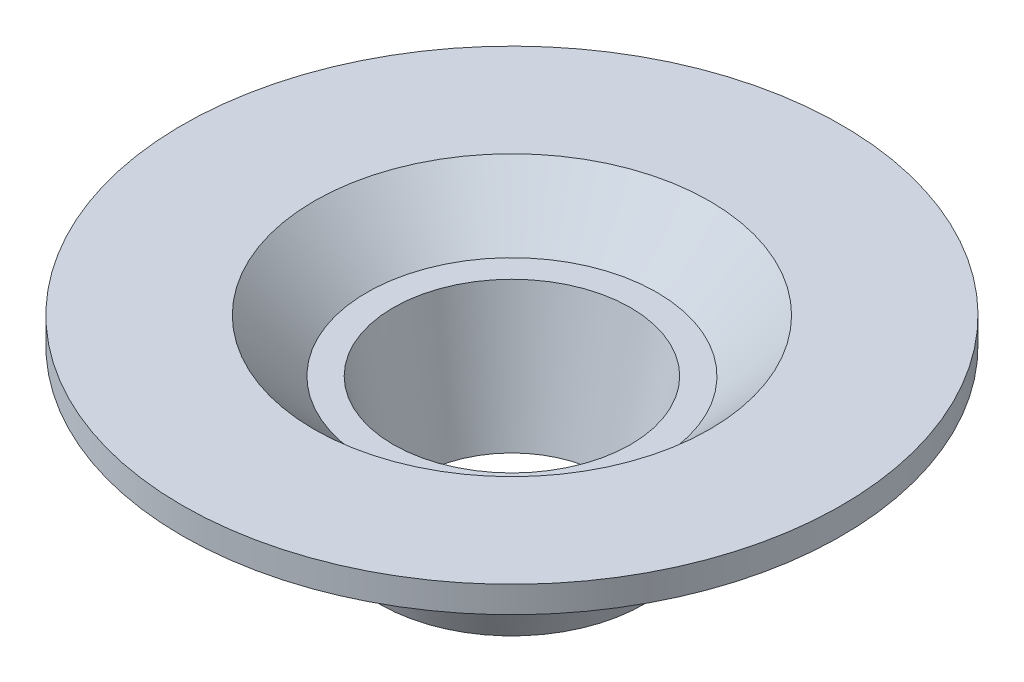
ISO-10303-21;
HEADER;
FILE_DESCRIPTION(('STEP AP214'),'2;1');
FILE_NAME('part.step','',(''),(''),'','','');
FILE_SCHEMA(('AUTOMOTIVE_DESIGN { 1 0 10303 214 1 1 1 1 }'));
ENDSEC;
DATA;
#1=APPLICATION_CONTEXT('core data for automotive mechanical design processes');
#2=APPLICATION_PROTOCOL_DEFINITION('international standard','automotive_design',2000,#1);
#3=PRODUCT_CONTEXT('',#1,'mechanical');
#4=PRODUCT('Part','Part','',(#3));
#5=PRODUCT_RELATED_PRODUCT_CATEGORY('part','',(#4));
#6=PRODUCT_DEFINITION_FORMATION('','',#4);
#7=PRODUCT_DEFINITION_CONTEXT('part definition',#1,'design');
#8=PRODUCT_DEFINITION('design','',#6,#7);
#9=PRODUCT_DEFINITION_SHAPE('','',#8);
#10=(LENGTH_UNIT() NAMED_UNIT(*) SI_UNIT(.MILLI.,.METRE.));
#11=(NAMED_UNIT(*) PLANE_ANGLE_UNIT() SI_UNIT($,.RADIAN.));
#12=(NAMED_UNIT(*) SI_UNIT($,.STERADIAN.) SOLID_ANGLE_UNIT());
#13=UNCERTAINTY_MEASURE_WITH_UNIT(LENGTH_MEASURE(1.E-05),#10,'distance_accuracy_value','');
#14=(GEOMETRIC_REPRESENTATION_CONTEXT(3) GLOBAL_UNCERTAINTY_ASSIGNED_CONTEXT((#13)) GLOBAL_UNIT_ASSIGNED_CONTEXT((#10,
#11,#12)) REPRESENTATION_CONTEXT('',''));
#15=CARTESIAN_POINT('',(0.,0.,0.));
#16=DIRECTION('',(0.,0.,1.));
#17=DIRECTION('',(1.,0.,0.));
#18=AXIS2_PLACEMENT_3D('',#15,#16,#17);
#19=CARTESIAN_POINT('',(0.,-5.,-3.5));
#20=DIRECTION('',(0.,1.,0.));
#21=DIRECTION('',(0.,0.,1.));
#22=AXIS2_PLACEMENT_3D('',#19,#20,#21);
#23=PLANE('',#22);
#24=CARTESIAN_POINT('',(0.,-5.,0.));
#25=DIRECTION('',(0.,1.,0.));
#26=DIRECTION('',(0.,0.,1.));
#27=AXIS2_PLACEMENT_3D('',#24,#25,#26);
#28=CIRCLE('',#27,5.);
#29=CARTESIAN_POINT('',(0.,-5.,5.));
#30=VERTEX_POINT('',#29);
#31=EDGE_CURVE('E10',#30,#30,#28,.T.);
#32=ORIENTED_EDGE('',*,*,#31,.F.);
#33=EDGE_LOOP('',(#32));
#34=FACE_BOUND('',#33,.T.);
#35=CARTESIAN_POINT('',(0.,-5.,0.));
#36=DIRECTION('',(0.,1.,0.));
#37=DIRECTION('',(0.,0.,1.));
#38=AXIS2_PLACEMENT_3D('',#35,#36,#37);
#39=CIRCLE('',#38,3.5);
#40=CARTESIAN_POINT('',(0.,-5.,3.5));
#41=VERTEX_POINT('',#40);
#42=EDGE_CURVE('E65',#41,#41,#39,.T.);
#43=ORIENTED_EDGE('',*,*,#42,.T.);
#44=EDGE_LOOP('',(#43));
#45=FACE_BOUND('',#44,.T.);
#46=ADVANCED_FACE('F31',(#34,#45),#23,.F.);
#47=CARTESIAN_POINT('',(0.,-5.,0.));
#48=DIRECTION('',(0.,1.,0.));
#49=DIRECTION('',(0.,0.,1.));
#50=AXIS2_PLACEMENT_3D('',#47,#48,#49);
#51=CONICAL_SURFACE('',#50,5.,0.358770670270572);
#52=CARTESIAN_POINT('',(0.,-1.,0.));
#53=DIRECTION('',(0.,1.,0.));
#54=DIRECTION('',(0.,0.,1.));
#55=AXIS2_PLACEMENT_3D('',#52,#53,#54);
#56=CIRCLE('',#55,6.5);
#57=CARTESIAN_POINT('',(0.,-1.,6.5));
#58=VERTEX_POINT('',#57);
#59=EDGE_CURVE('E37',#58,#58,#56,.T.);
#60=ORIENTED_EDGE('',*,*,#59,.F.);
#61=EDGE_LOOP('',(#60));
#62=FACE_BOUND('',#61,.T.);
#63=ORIENTED_EDGE('',*,*,#31,.T.);
#64=EDGE_LOOP('',(#63));
#65=FACE_BOUND('',#64,.T.);
#66=ADVANCED_FACE('F114',(#62,#65),#51,.T.);
#67=CARTESIAN_POINT('',(0.,-1.,-6.5));
#68=DIRECTION('',(0.,1.,0.));
#69=DIRECTION('',(0.,0.,1.));
#70=AXIS2_PLACEMENT_3D('',#67,#68,#69);
#71=PLANE('',#70);
#72=CARTESIAN_POINT('',(0.,-1.,0.));
#73=DIRECTION('',(0.,1.,0.));
#74=DIRECTION('',(0.,0.,1.));
#75=AXIS2_PLACEMENT_3D('',#72,#73,#74);
#76=CIRCLE('',#75,8.5);
#77=CARTESIAN_POINT('',(0.,-1.,8.5));
#78=VERTEX_POINT('',#77);
#79=EDGE_CURVE('E41',#78,#78,#76,.T.);
#80=ORIENTED_EDGE('',*,*,#79,.F.);
#81=EDGE_LOOP('',(#80));
#82=FACE_BOUND('',#81,.T.);
#83=ORIENTED_EDGE('',*,*,#59,.T.);
#84=EDGE_LOOP('',(#83));
#85=FACE_BOUND('',#84,.T.);
#86=ADVANCED_FACE('F109',(#82,#85),#71,.F.);
#87=CARTESIAN_POINT('',(0.,-1.,0.));
#88=DIRECTION('',(0.,1.,0.));
#89=DIRECTION('',(0.,0.,1.));
#90=AXIS2_PLACEMENT_3D('',#87,#88,#89);
#91=CONICAL_SURFACE('',#90,8.5,0.785398163397448);
#92=CARTESIAN_POINT('',(0.,1.,0.));
#93=DIRECTION('',(0.,1.,0.));
#94=DIRECTION('',(0.,0.,1.));
#95=AXIS2_PLACEMENT_3D('',#92,#93,#94);
#96=CIRCLE('',#95,10.5);
#97=CARTESIAN_POINT('',(0.,0.999999999999999,10.5));
#98=VERTEX_POINT('',#97);
#99=EDGE_CURVE('E45',#98,#98,#96,.T.);
#100=ORIENTED_EDGE('',*,*,#99,.F.);
#101=EDGE_LOOP('',(#100));
#102=FACE_BOUND('',#101,.T.);
#103=ORIENTED_EDGE('',*,*,#79,.T.);
#104=EDGE_LOOP('',(#103));
#105=FACE_BOUND('',#104,.T.);
#106=ADVANCED_FACE('F103',(#102,#105),#91,.T.);
#107=CARTESIAN_POINT('',(0.,1.,-10.5));
#108=DIRECTION('',(0.,1.,0.));
#109=DIRECTION('',(0.,0.,1.));
#110=AXIS2_PLACEMENT_3D('',#107,#108,#109);
#111=PLANE('',#110);
#112=CARTESIAN_POINT('',(0.,1.,0.));
#113=DIRECTION('',(0.,1.,0.));
#114=DIRECTION('',(0.,0.,1.));
#115=AXIS2_PLACEMENT_3D('',#112,#113,#114);
#116=CIRCLE('',#115,12.5);
#117=CARTESIAN_POINT('',(0.,0.999999999999999,12.5));
#118=VERTEX_POINT('',#117);
#119=EDGE_CURVE('E50',#118,#118,#116,.T.);
#120=ORIENTED_EDGE('',*,*,#119,.F.);
#121=EDGE_LOOP('',(#120));
#122=FACE_BOUND('',#121,.T.);
#123=ORIENTED_EDGE('',*,*,#99,.T.);
#124=EDGE_LOOP('',(#123));
#125=FACE_BOUND('',#124,.T.);
#126=ADVANCED_FACE('F97',(#122,#125),#111,.F.);
#127=CARTESIAN_POINT('',(0.,0.,0.));
#128=DIRECTION('',(0.,1.,0.));
#129=DIRECTION('',(0.,0.,1.));
#130=AXIS2_PLACEMENT_3D('',#127,#128,#129);
#131=CYLINDRICAL_SURFACE('',#130,12.5);
#132=CARTESIAN_POINT('',(0.,2.,0.));
#133=DIRECTION('',(0.,1.,0.));
#134=DIRECTION('',(0.,0.,1.));
#135=AXIS2_PLACEMENT_3D('',#132,#133,#134);
#136=CIRCLE('',#135,12.5);
#137=CARTESIAN_POINT('',(0.,2.,12.5));
#138=VERTEX_POINT('',#137);
#139=EDGE_CURVE('E53',#138,#138,#136,.T.);
#140=ORIENTED_EDGE('',*,*,#139,.F.);
#141=EDGE_LOOP('',(#140));
#142=FACE_BOUND('',#141,.T.);
#143=ORIENTED_EDGE('',*,*,#119,.T.);
#144=EDGE_LOOP('',(#143));
#145=FACE_BOUND('',#144,.T.);
#146=ADVANCED_FACE('F91',(#142,#145),#131,.T.);
#147=CARTESIAN_POINT('',(0.,2.,-12.5));
#148=DIRECTION('',(0.,-1.,0.));
#149=DIRECTION('',(0.,0.,-1.));
#150=AXIS2_PLACEMENT_3D('',#147,#148,#149);
#151=PLANE('',#150);
#152=CARTESIAN_POINT('',(0.,2.,0.));
#153=DIRECTION('',(0.,1.,0.));
#154=DIRECTION('',(0.,0.,1.));
#155=AXIS2_PLACEMENT_3D('',#152,#153,#154);
#156=CIRCLE('',#155,7.5);
#157=CARTESIAN_POINT('',(0.,2.,7.5));
#158=VERTEX_POINT('',#157);
#159=EDGE_CURVE('E56',#158,#158,#156,.T.);
#160=ORIENTED_EDGE('',*,*,#159,.F.);
#161=EDGE_LOOP('',(#160));
#162=FACE_BOUND('',#161,.T.);
#163=ORIENTED_EDGE('',*,*,#139,.T.);
#164=EDGE_LOOP('',(#163));
#165=FACE_BOUND('',#164,.T.);
#166=ADVANCED_FACE('F85',(#162,#165),#151,.F.);
#167=CARTESIAN_POINT('',(0.,2.,0.));
#168=DIRECTION('',(0.,1.,0.));
#169=DIRECTION('',(0.,0.,1.));
#170=AXIS2_PLACEMENT_3D('',#167,#168,#169);
#171=CONICAL_SURFACE('',#170,7.5,0.785398163397448);
#172=CARTESIAN_POINT('',(0.,0.,0.));
#173=DIRECTION('',(0.,1.,0.));
#174=DIRECTION('',(0.,0.,1.));
#175=AXIS2_PLACEMENT_3D('',#172,#173,#174);
#176=CIRCLE('',#175,5.5);
#177=CARTESIAN_POINT('',(0.,0.,5.5));
#178=VERTEX_POINT('',#177);
#179=EDGE_CURVE('E59',#178,#178,#176,.T.);
#180=ORIENTED_EDGE('',*,*,#179,.F.);
#181=EDGE_LOOP('',(#180));
#182=FACE_BOUND('',#181,.T.);
#183=ORIENTED_EDGE('',*,*,#159,.T.);
#184=EDGE_LOOP('',(#183));
#185=FACE_BOUND('',#184,.T.);
#186=ADVANCED_FACE('F79',(#182,#185),#171,.F.);
#187=CARTESIAN_POINT('',(0.,0.,-5.5));
#188=DIRECTION('',(0.,-1.,0.));
#189=DIRECTION('',(0.,0.,-1.));
#190=AXIS2_PLACEMENT_3D('',#187,#188,#189);
#191=PLANE('',#190);
#192=CARTESIAN_POINT('',(0.,0.,0.));
#193=DIRECTION('',(0.,1.,0.));
#194=DIRECTION('',(0.,0.,1.));
#195=AXIS2_PLACEMENT_3D('',#192,#193,#194);
#196=CIRCLE('',#195,4.5);
#197=CARTESIAN_POINT('',(0.,0.,4.5));
#198=VERTEX_POINT('',#197);
#199=EDGE_CURVE('E62',#198,#198,#196,.T.);
#200=ORIENTED_EDGE('',*,*,#199,.F.);
#201=EDGE_LOOP('',(#200));
#202=FACE_BOUND('',#201,.T.);
#203=ORIENTED_EDGE('',*,*,#179,.T.);
#204=EDGE_LOOP('',(#203));
#205=FACE_BOUND('',#204,.T.);
#206=ADVANCED_FACE('F73',(#202,#205),#191,.F.);
#207=CARTESIAN_POINT('',(0.,0.,0.));
#208=DIRECTION('',(0.,1.,0.));
#209=DIRECTION('',(0.,0.,1.));
#210=AXIS2_PLACEMENT_3D('',#207,#208,#209);
#211=CONICAL_SURFACE('',#210,4.5,0.197395559849881);
#212=ORIENTED_EDGE('',*,*,#42,.F.);
#213=EDGE_LOOP('',(#212));
#214=FACE_BOUND('',#213,.T.);
#215=ORIENTED_EDGE('',*,*,#199,.T.);
#216=EDGE_LOOP('',(#215));
#217=FACE_BOUND('',#216,.T.);
#218=ADVANCED_FACE('F70',(#214,#217),#211,.F.);
#219=CLOSED_SHELL('',(#46,#66,#86,#106,#126,#146,#166,#186,#206,#218));
#220=MANIFOLD_SOLID_BREP('B2',#219);
#221=ADVANCED_BREP_SHAPE_REPRESENTATION('',(#18,#220),#14);
#222=SHAPE_DEFINITION_REPRESENTATION(#9,#221);
ENDSEC;
END-ISO-10303-21;
